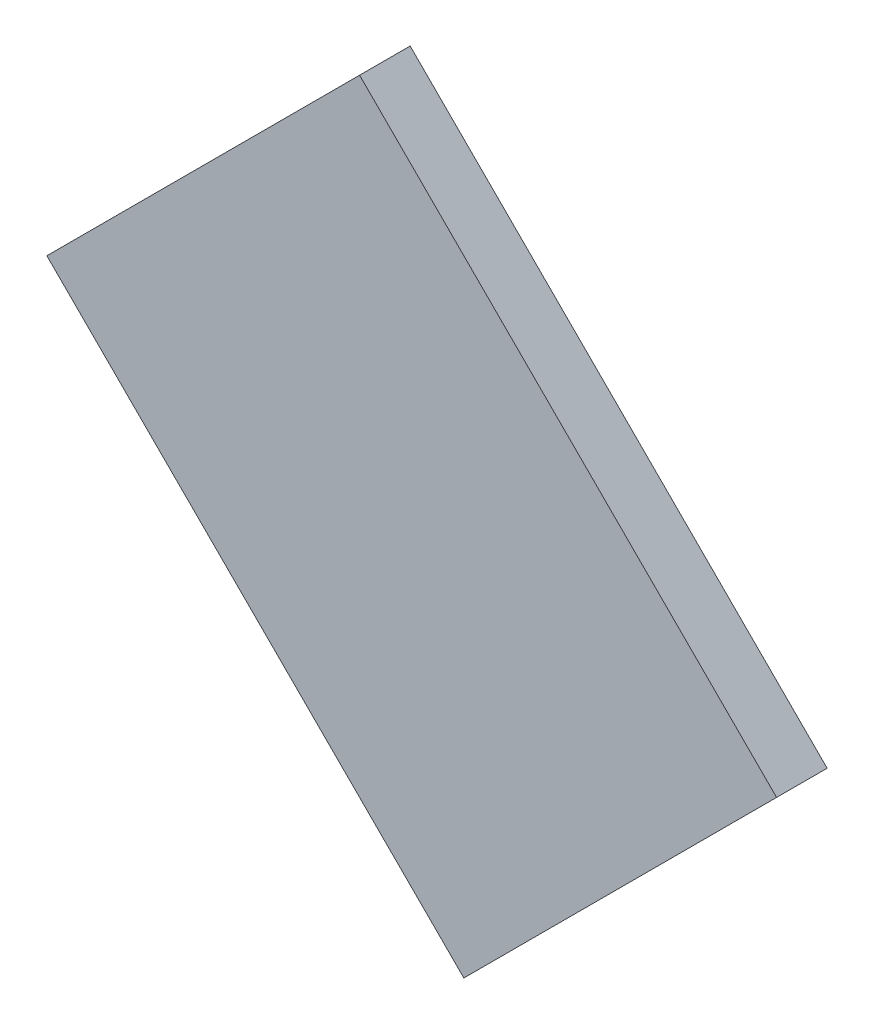
ISO-10303-21;
HEADER;
FILE_DESCRIPTION(('STEP AP214'),'2;1');
FILE_NAME('part.step','',(''),(''),'','','');
FILE_SCHEMA(('AUTOMOTIVE_DESIGN { 1 0 10303 214 1 1 1 1 }'));
ENDSEC;
DATA;
#1=APPLICATION_CONTEXT('core data for automotive mechanical design processes');
#2=APPLICATION_PROTOCOL_DEFINITION('international standard','automotive_design',2000,#1);
#3=PRODUCT_CONTEXT('',#1,'mechanical');
#4=PRODUCT('Part','Part','',(#3));
#5=PRODUCT_RELATED_PRODUCT_CATEGORY('part','',(#4));
#6=PRODUCT_DEFINITION_FORMATION('','',#4);
#7=PRODUCT_DEFINITION_CONTEXT('part definition',#1,'design');
#8=PRODUCT_DEFINITION('design','',#6,#7);
#9=PRODUCT_DEFINITION_SHAPE('','',#8);
#10=(LENGTH_UNIT() NAMED_UNIT(*) SI_UNIT(.MILLI.,.METRE.));
#11=(NAMED_UNIT(*) PLANE_ANGLE_UNIT() SI_UNIT($,.RADIAN.));
#12=(NAMED_UNIT(*) SI_UNIT($,.STERADIAN.) SOLID_ANGLE_UNIT());
#13=UNCERTAINTY_MEASURE_WITH_UNIT(LENGTH_MEASURE(1.E-05),#10,'distance_accuracy_value','');
#14=(GEOMETRIC_REPRESENTATION_CONTEXT(3) GLOBAL_UNCERTAINTY_ASSIGNED_CONTEXT((#13)) GLOBAL_UNIT_ASSIGNED_CONTEXT((#10,
#11,#12)) REPRESENTATION_CONTEXT('',''));
#15=CARTESIAN_POINT('',(0.,0.,0.));
#16=DIRECTION('',(0.,0.,1.));
#17=DIRECTION('',(1.,0.,0.));
#18=AXIS2_PLACEMENT_3D('',#15,#16,#17);
#19=CARTESIAN_POINT('',(3.8012546665,10.3290546665,0.76487));
#20=DIRECTION('',(0.,0.,-1.));
#21=DIRECTION('',(0.,1.,0.));
#22=AXIS2_PLACEMENT_3D('',#19,#20,#21);
#23=PLANE('',#22);
#24=DIRECTION('',(0.707106781186548,0.707106781186548,0.));
#25=VECTOR('',#24,1.);
#26=CARTESIAN_POINT('',(3.553767333,10.36441,0.76487));
#27=LINE('',#26,#25);
#28=CARTESIAN_POINT('',(3.553767333,10.36441,0.76487));
#29=VERTEX_POINT('',#28);
#30=CARTESIAN_POINT('',(3.765899333,10.576542,0.76487));
#31=VERTEX_POINT('',#30);
#32=EDGE_CURVE('E55',#29,#31,#27,.T.);
#33=ORIENTED_EDGE('',*,*,#32,.T.);
#34=DIRECTION('',(0.707106781186548,-0.707106781186548,0.));
#35=VECTOR('',#34,1.);
#36=CARTESIAN_POINT('',(3.765899333,10.576542,0.76487));
#37=LINE('',#36,#35);
#38=CARTESIAN_POINT('',(4.048742,10.293699333,0.76487));
#39=VERTEX_POINT('',#38);
#40=EDGE_CURVE('E57',#31,#39,#37,.T.);
#41=ORIENTED_EDGE('',*,*,#40,.T.);
#42=DIRECTION('',(-0.707106781186548,-0.707106781186548,0.));
#43=VECTOR('',#42,1.);
#44=CARTESIAN_POINT('',(4.048742,10.293699333,0.76487));
#45=LINE('',#44,#43);
#46=CARTESIAN_POINT('',(3.83661,10.081567333,0.76487));
#47=VERTEX_POINT('',#46);
#48=EDGE_CURVE('E20',#39,#47,#45,.T.);
#49=ORIENTED_EDGE('',*,*,#48,.T.);
#50=DIRECTION('',(-0.707106781186548,0.707106781186548,0.));
#51=VECTOR('',#50,1.);
#52=CARTESIAN_POINT('',(3.83661,10.081567333,0.76487));
#53=LINE('',#52,#51);
#54=EDGE_CURVE('E80',#47,#29,#53,.T.);
#55=ORIENTED_EDGE('',*,*,#54,.T.);
#56=EDGE_LOOP('',(#33,#41,#49,#55));
#57=FACE_BOUND('',#56,.T.);
#58=ADVANCED_FACE('F17',(#57),#23,.T.);
#59=CARTESIAN_POINT('',(4.048742,10.293699333,0.76487));
#60=DIRECTION('',(-0.707106781186548,0.707106781186548,0.));
#61=DIRECTION('',(-0.707106781186548,-0.707106781186548,0.));
#62=AXIS2_PLACEMENT_3D('',#59,#60,#61);
#63=PLANE('',#62);
#64=DIRECTION('',(0.,0.,1.));
#65=VECTOR('',#64,1.);
#66=CARTESIAN_POINT('',(3.83661,10.081567333,0.76487));
#67=LINE('',#66,#65);
#68=CARTESIAN_POINT('',(3.83661,10.081567333,0.79916));
#69=VERTEX_POINT('',#68);
#70=EDGE_CURVE('E68',#69,#47,#67,.F.);
#71=ORIENTED_EDGE('',*,*,#70,.T.);
#72=ORIENTED_EDGE('',*,*,#48,.F.);
#73=DIRECTION('',(0.,0.,1.));
#74=VECTOR('',#73,1.);
#75=CARTESIAN_POINT('',(4.048742,10.293699333,0.76487));
#76=LINE('',#75,#74);
#77=CARTESIAN_POINT('',(4.048742,10.293699333,0.79916));
#78=VERTEX_POINT('',#77);
#79=EDGE_CURVE('E63',#39,#78,#76,.T.);
#80=ORIENTED_EDGE('',*,*,#79,.T.);
#81=DIRECTION('',(0.70710678118655,0.707106781186545,0.));
#82=VECTOR('',#81,1.);
#83=CARTESIAN_POINT('',(3.83661,10.081567333,0.79916));
#84=LINE('',#83,#82);
#85=EDGE_CURVE('E83',#69,#78,#84,.T.);
#86=ORIENTED_EDGE('',*,*,#85,.F.);
#87=EDGE_LOOP('',(#71,#72,#80,#86));
#88=FACE_BOUND('',#87,.T.);
#89=ADVANCED_FACE('F65',(#88),#63,.F.);
#90=CARTESIAN_POINT('',(3.765899333,10.576542,0.76487));
#91=DIRECTION('',(-0.707106781186548,-0.707106781186548,0.));
#92=DIRECTION('',(0.707106781186548,-0.707106781186548,0.));
#93=AXIS2_PLACEMENT_3D('',#90,#91,#92);
#94=PLANE('',#93);
#95=ORIENTED_EDGE('',*,*,#79,.F.);
#96=ORIENTED_EDGE('',*,*,#40,.F.);
#97=DIRECTION('',(0.,0.,1.));
#98=VECTOR('',#97,1.);
#99=CARTESIAN_POINT('',(3.765899333,10.576542,0.76487));
#100=LINE('',#99,#98);
#101=CARTESIAN_POINT('',(3.765899333,10.576542,0.79916));
#102=VERTEX_POINT('',#101);
#103=EDGE_CURVE('E75',#31,#102,#100,.T.);
#104=ORIENTED_EDGE('',*,*,#103,.T.);
#105=DIRECTION('',(-0.707106781186547,0.707106781186548,0.));
#106=VECTOR('',#105,1.);
#107=CARTESIAN_POINT('',(4.048742,10.293699333,0.79916));
#108=LINE('',#107,#106);
#109=EDGE_CURVE('E72',#78,#102,#108,.T.);
#110=ORIENTED_EDGE('',*,*,#109,.F.);
#111=EDGE_LOOP('',(#95,#96,#104,#110));
#112=FACE_BOUND('',#111,.T.);
#113=ADVANCED_FACE('F70',(#112),#94,.F.);
#114=CARTESIAN_POINT('',(3.553767333,10.36441,0.76487));
#115=DIRECTION('',(0.707106781186548,-0.707106781186548,0.));
#116=DIRECTION('',(0.707106781186548,0.707106781186548,0.));
#117=AXIS2_PLACEMENT_3D('',#114,#115,#116);
#118=PLANE('',#117);
#119=ORIENTED_EDGE('',*,*,#103,.F.);
#120=ORIENTED_EDGE('',*,*,#32,.F.);
#121=DIRECTION('',(0.,0.,1.));
#122=VECTOR('',#121,1.);
#123=CARTESIAN_POINT('',(3.553767333,10.36441,0.76487));
#124=LINE('',#123,#122);
#125=CARTESIAN_POINT('',(3.553767333,10.36441,0.79916));
#126=VERTEX_POINT('',#125);
#127=EDGE_CURVE('E35',#29,#126,#124,.T.);
#128=ORIENTED_EDGE('',*,*,#127,.T.);
#129=DIRECTION('',(-0.707106781186547,-0.707106781186548,0.));
#130=VECTOR('',#129,1.);
#131=CARTESIAN_POINT('',(3.765899333,10.576542,0.79916));
#132=LINE('',#131,#130);
#133=EDGE_CURVE('E26',#102,#126,#132,.T.);
#134=ORIENTED_EDGE('',*,*,#133,.F.);
#135=EDGE_LOOP('',(#119,#120,#128,#134));
#136=FACE_BOUND('',#135,.T.);
#137=ADVANCED_FACE('F89',(#136),#118,.F.);
#138=CARTESIAN_POINT('',(3.83661,10.081567333,0.76487));
#139=DIRECTION('',(0.707106781186548,0.707106781186548,0.));
#140=DIRECTION('',(-0.707106781186548,0.707106781186548,0.));
#141=AXIS2_PLACEMENT_3D('',#138,#139,#140);
#142=PLANE('',#141);
#143=ORIENTED_EDGE('',*,*,#127,.F.);
#144=ORIENTED_EDGE('',*,*,#54,.F.);
#145=ORIENTED_EDGE('',*,*,#70,.F.);
#146=DIRECTION('',(0.707106781186549,-0.707106781186547,0.));
#147=VECTOR('',#146,1.);
#148=CARTESIAN_POINT('',(3.553767333,10.36441,0.79916));
#149=LINE('',#148,#147);
#150=EDGE_CURVE('E11',#126,#69,#149,.T.);
#151=ORIENTED_EDGE('',*,*,#150,.F.);
#152=EDGE_LOOP('',(#143,#144,#145,#151));
#153=FACE_BOUND('',#152,.T.);
#154=ADVANCED_FACE('F91',(#153),#142,.F.);
#155=CARTESIAN_POINT('',(3.8012546665,10.3290546665,0.79916));
#156=DIRECTION('',(0.,0.,1.));
#157=DIRECTION('',(0.,-1.,0.));
#158=AXIS2_PLACEMENT_3D('',#155,#156,#157);
#159=PLANE('',#158);
#160=ORIENTED_EDGE('',*,*,#133,.T.);
#161=ORIENTED_EDGE('',*,*,#150,.T.);
#162=ORIENTED_EDGE('',*,*,#85,.T.);
#163=ORIENTED_EDGE('',*,*,#109,.T.);
#164=EDGE_LOOP('',(#160,#161,#162,#163));
#165=FACE_BOUND('',#164,.T.);
#166=ADVANCED_FACE('F88',(#165),#159,.T.);
#167=CLOSED_SHELL('',(#58,#89,#113,#137,#154,#166));
#168=MANIFOLD_SOLID_BREP('B1',#167);
#169=ADVANCED_BREP_SHAPE_REPRESENTATION('',(#18,#168),#14);
#170=SHAPE_DEFINITION_REPRESENTATION(#9,#169);
ENDSEC;
END-ISO-10303-21;
